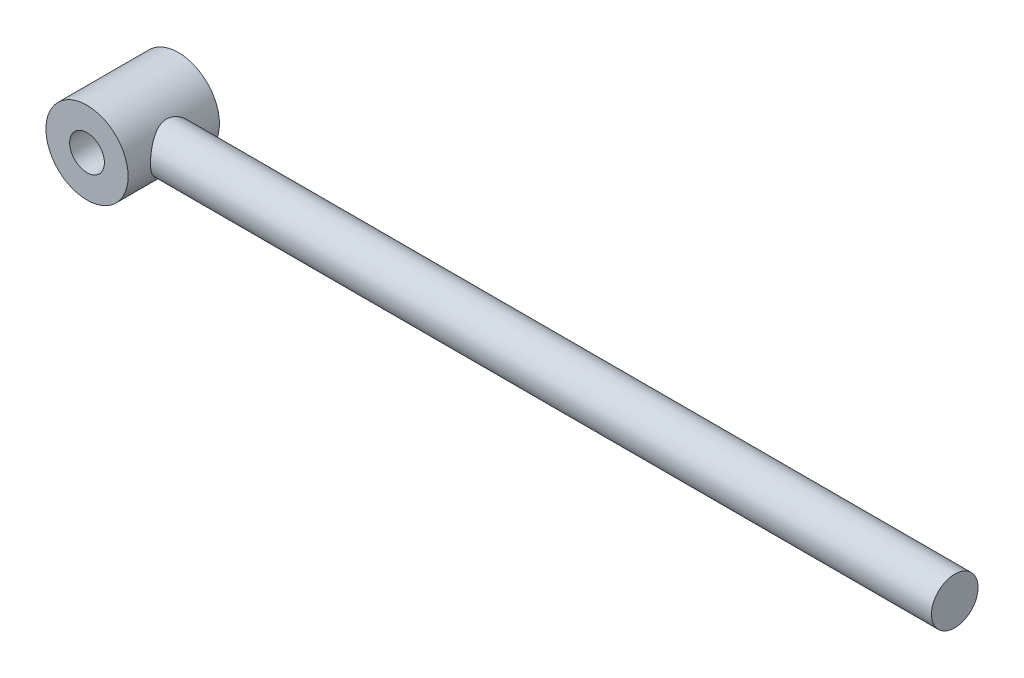
ISO-10303-21;
HEADER;
FILE_DESCRIPTION(('STEP AP214'),'2;1');
FILE_NAME('part.step','',(''),(''),'','','');
FILE_SCHEMA(('AUTOMOTIVE_DESIGN { 1 0 10303 214 1 1 1 1 }'));
ENDSEC;
DATA;
#1=APPLICATION_CONTEXT('core data for automotive mechanical design processes');
#2=APPLICATION_PROTOCOL_DEFINITION('international standard','automotive_design',2000,#1);
#3=PRODUCT_CONTEXT('',#1,'mechanical');
#4=PRODUCT('Part','Part','',(#3));
#5=PRODUCT_RELATED_PRODUCT_CATEGORY('part','',(#4));
#6=PRODUCT_DEFINITION_FORMATION('','',#4);
#7=PRODUCT_DEFINITION_CONTEXT('part definition',#1,'design');
#8=PRODUCT_DEFINITION('design','',#6,#7);
#9=PRODUCT_DEFINITION_SHAPE('','',#8);
#10=(LENGTH_UNIT() NAMED_UNIT(*) SI_UNIT(.MILLI.,.METRE.));
#11=(NAMED_UNIT(*) PLANE_ANGLE_UNIT() SI_UNIT($,.RADIAN.));
#12=(NAMED_UNIT(*) SI_UNIT($,.STERADIAN.) SOLID_ANGLE_UNIT());
#13=UNCERTAINTY_MEASURE_WITH_UNIT(LENGTH_MEASURE(1.E-05),#10,'distance_accuracy_value','');
#14=(GEOMETRIC_REPRESENTATION_CONTEXT(3) GLOBAL_UNCERTAINTY_ASSIGNED_CONTEXT((#13)) GLOBAL_UNIT_ASSIGNED_CONTEXT((#10,
#11,#12)) REPRESENTATION_CONTEXT('',''));
#15=CARTESIAN_POINT('',(0.,0.,0.));
#16=DIRECTION('',(0.,0.,1.));
#17=DIRECTION('',(1.,0.,0.));
#18=AXIS2_PLACEMENT_3D('',#15,#16,#17);
#19=CARTESIAN_POINT('',(0.,0.,0.));
#20=DIRECTION('',(-1.,0.,0.));
#21=DIRECTION('',(0.,0.,1.));
#22=AXIS2_PLACEMENT_3D('',#19,#20,#21);
#23=CYLINDRICAL_SURFACE('',#22,51.);
#24=CARTESIAN_POINT('',(1800.,0.,0.));
#25=DIRECTION('',(-1.,0.,0.));
#26=DIRECTION('',(0.,0.,1.));
#27=AXIS2_PLACEMENT_3D('',#24,#25,#26);
#28=CIRCLE('',#27,51.);
#29=CARTESIAN_POINT('',(1800.,0.,51.));
#30=VERTEX_POINT('',#29);
#31=EDGE_CURVE('E41',#30,#30,#28,.T.);
#32=ORIENTED_EDGE('',*,*,#31,.T.);
#33=EDGE_LOOP('',(#32));
#34=FACE_BOUND('',#33,.T.);
#35=CARTESIAN_POINT('',(90.,0.,51.));
#36=CARTESIAN_POINT('',(89.9999999080098,0.658621829089506,50.9999999638465));
#37=CARTESIAN_POINT('',(89.9927659409652,1.31726335082432,50.9872373579732));
#38=CARTESIAN_POINT('',(89.963875940105,2.6333116588061,50.9362288169427));
#39=CARTESIAN_POINT('',(89.9422180661184,3.29071827677375,50.8979796302622));
#40=CARTESIAN_POINT('',(89.8845999398963,4.60330008210929,50.796093324817));
#41=CARTESIAN_POINT('',(89.8486320450583,5.25847388810619,50.7324426397303));
#42=CARTESIAN_POINT('',(89.7626314540965,6.5649784126537,50.5799750381786));
#43=CARTESIAN_POINT('',(89.7125972735262,7.21630871818016,50.4911554655768));
#44=CARTESIAN_POINT('',(89.541576177841,9.16560794786795,50.1868782531181));
#45=CARTESIAN_POINT('',(89.3997926424242,10.4561460536715,49.9338157269512));
#46=CARTESIAN_POINT('',(89.0644314781864,13.0070316657186,49.3308773469284));
#47=CARTESIAN_POINT('',(88.8708619029722,14.2673838332092,48.9810165465557));
#48=CARTESIAN_POINT('',(88.4375659404354,16.7442503215382,48.1903711505728));
#49=CARTESIAN_POINT('',(88.198063716426,17.9609448011078,47.7500274187819));
#50=CARTESIAN_POINT('',(87.6777020699198,20.3498240387217,46.781898357253));
#51=CARTESIAN_POINT('',(87.3968411907211,21.5220072271947,46.2541099475257));
#52=CARTESIAN_POINT('',(86.799909037017,23.8155292153693,45.1160590879025));
#53=CARTESIAN_POINT('',(86.4838533404445,24.9368902031949,44.5058331012392));
#54=CARTESIAN_POINT('',(85.8228734757845,27.124534036798,43.2073820155322));
#55=CARTESIAN_POINT('',(85.4779482752954,28.1908149106503,42.5191541267528));
#56=CARTESIAN_POINT('',(84.7405311277791,30.3384546740823,41.017261800924));
#57=CARTESIAN_POINT('',(84.3464015054075,31.4154402991066,40.1981469948753));
#58=CARTESIAN_POINT('',(83.5414364416782,33.4973771522562,38.4804786321007));
#59=CARTESIAN_POINT('',(83.1306003033369,34.5023253701914,37.5819217592699));
#60=CARTESIAN_POINT('',(82.3007860533188,36.4374829845075,35.708893441112));
#61=CARTESIAN_POINT('',(81.881799517757,37.3676093260092,34.7343399362332));
#62=CARTESIAN_POINT('',(81.0455462987467,39.1482712819762,32.7143073059673));
#63=CARTESIAN_POINT('',(80.6282797011267,39.9988029693862,31.6688246854519));
#64=CARTESIAN_POINT('',(79.7614626999218,41.7027261083245,29.3957377024492));
#65=CARTESIAN_POINT('',(79.3132112113563,42.5467613273708,28.1605986568506));
#66=CARTESIAN_POINT('',(78.4449790216047,44.1270721785443,25.6134339740721));
#67=CARTESIAN_POINT('',(78.0250022389618,44.8633328909218,24.3013977267786));
#68=CARTESIAN_POINT('',(77.2286824809824,46.2206579184427,21.6083683591209));
#69=CARTESIAN_POINT('',(76.8522868032307,46.8418619282162,20.2274614786219));
#70=CARTESIAN_POINT('',(76.157742904245,47.9628363133805,17.403233338064));
#71=CARTESIAN_POINT('',(75.8395760059921,48.4626456432887,15.9599322753577));
#72=CARTESIAN_POINT('',(75.3374309399517,49.2385595362806,13.3417012963912));
#73=CARTESIAN_POINT('',(75.1393199933618,49.5396785437326,12.176841997503));
#74=CARTESIAN_POINT('',(74.793766117107,50.059868088418,9.82157410141827));
#75=CARTESIAN_POINT('',(74.6463158356272,50.2789505311145,8.63116923802484));
#76=CARTESIAN_POINT('',(74.4072083723645,50.6321337009234,6.23332134679893));
#77=CARTESIAN_POINT('',(74.3155015017695,50.7663101163451,5.0258944775222));
#78=CARTESIAN_POINT('',(74.1909845181348,50.9481117249097,2.60145037472673));
#79=CARTESIAN_POINT('',(74.1581755996714,50.9957351625736,1.38443294719382));
#80=CARTESIAN_POINT('',(74.1526830467022,51.0037217359899,-1.05157440926389));
#81=CARTESIAN_POINT('',(74.180075946213,50.963973797304,-2.27056487806642));
#82=CARTESIAN_POINT('',(74.2941158407597,50.7975826648369,-4.69977416705972));
#83=CARTESIAN_POINT('',(74.3807630594106,50.6709391431277,-5.90999295413037));
#84=CARTESIAN_POINT('',(74.6102216217104,50.3324592330041,-8.31370266771475));
#85=CARTESIAN_POINT('',(74.7530651363031,50.1205740443403,-9.50718360620883));
#86=CARTESIAN_POINT('',(75.0900028869837,49.6143494553413,-11.8690890933385));
#87=CARTESIAN_POINT('',(75.2840983583419,49.3200080676435,-13.0375130373185));
#88=CARTESIAN_POINT('',(75.7167889255936,48.6531109085487,-15.3397307961167));
#89=CARTESIAN_POINT('',(75.9552620751651,48.2807691316978,-16.4736098321381));
#90=CARTESIAN_POINT('',(76.4702108944933,47.460941684386,-18.7048609988401));
#91=CARTESIAN_POINT('',(76.746686136222,47.0134568602692,-19.8022335405304));
#92=CARTESIAN_POINT('',(77.3305788801429,46.046719396909,-21.9566409068548));
#93=CARTESIAN_POINT('',(77.6380040475136,45.5274489670226,-23.0136656489587));
#94=CARTESIAN_POINT('',(78.2766077355745,44.4205017185265,-25.083799642933));
#95=CARTESIAN_POINT('',(78.6077880568575,43.8328197123498,-26.0969055564873));
#96=CARTESIAN_POINT('',(79.3405457668675,42.4940951863819,-28.232623593674));
#97=CARTESIAN_POINT('',(79.7449843122264,41.731908692777,-29.3472834811856));
#98=CARTESIAN_POINT('',(80.565974156775,40.1240415781845,-31.5099544226446));
#99=CARTESIAN_POINT('',(80.982526444613,39.2783541288005,-32.5579600143118));
#100=CARTESIAN_POINT('',(81.8181702318612,37.5066259263467,-34.5841790552293));
#101=CARTESIAN_POINT('',(82.2372634312384,36.5805241460756,-35.5623384533548));
#102=CARTESIAN_POINT('',(83.0682309729032,34.6521475700522,-37.4438700510101));
#103=CARTESIAN_POINT('',(83.4801049955662,33.6498694120686,-38.3472389457965));
#104=CARTESIAN_POINT('',(84.3320834946109,31.4583823518264,-40.1698785072367));
#105=CARTESIAN_POINT('',(84.7702959424847,30.2607460450239,-41.079927457434));
#106=CARTESIAN_POINT('',(85.6148039395976,27.7816327654551,-42.7954697806354));
#107=CARTESIAN_POINT('',(86.0210966706306,26.5001484079733,-43.6009539256527));
#108=CARTESIAN_POINT('',(86.5978279403758,24.5211952877012,-44.7245649455254));
#109=CARTESIAN_POINT('',(86.7846082079466,23.8521396765897,-45.0849766762772));
#110=CARTESIAN_POINT('',(87.1459840483812,22.4959894921595,-45.7767365070799));
#111=CARTESIAN_POINT('',(87.3205811146447,21.8088971440185,-46.1080881705564));
#112=CARTESIAN_POINT('',(87.6562968019721,20.4177791942096,-46.7407556856728));
#113=CARTESIAN_POINT('',(87.8174150206289,19.7137530877965,-47.0420706406266));
#114=CARTESIAN_POINT('',(88.1249153991751,18.2901462710512,-47.6136404049767));
#115=CARTESIAN_POINT('',(88.2712996382287,17.5705677728297,-47.8838995975264));
#116=CARTESIAN_POINT('',(88.5385608794815,16.1677764093895,-48.3747467603549));
#117=CARTESIAN_POINT('',(88.6605040170533,15.4855175082336,-48.5974825288622));
#118=CARTESIAN_POINT('',(88.8897798728475,14.1100343641761,-49.0145213916747));
#119=CARTESIAN_POINT('',(88.9971145585372,13.4168116119517,-49.2088283150436));
#120=CARTESIAN_POINT('',(89.1964259760255,12.0206039754423,-49.5683850908902));
#121=CARTESIAN_POINT('',(89.2884010823263,11.317618066443,-49.7336318680429));
#122=CARTESIAN_POINT('',(89.4562882588614,9.90350424911977,-50.0344189682704));
#123=CARTESIAN_POINT('',(89.5322022707981,9.19237733597049,-50.169962882337));
#124=CARTESIAN_POINT('',(89.6673617485588,7.76392696430004,-50.41076959027));
#125=CARTESIAN_POINT('',(89.7266182413271,7.04660793058549,-50.5160524174128));
#126=CARTESIAN_POINT('',(89.8280680770903,5.60703269557511,-50.6960287730588));
#127=CARTESIAN_POINT('',(89.8702635183636,4.88477711252544,-50.7707260631834));
#128=CARTESIAN_POINT('',(89.9372699532949,3.43693586309107,-50.8892419338477));
#129=CARTESIAN_POINT('',(89.9620813904866,2.71135028214307,-50.9330613022037));
#130=CARTESIAN_POINT('',(89.9941329310163,1.25865312507203,-50.9896499692921));
#131=CARTESIAN_POINT('',(90.001373553904,0.531541594705959,-51.0024201861136));
#132=CARTESIAN_POINT('',(89.9969936872876,-1.47638389890575,-50.9947013143533));
#133=CARTESIAN_POINT('',(89.9668133843013,-2.75723343120374,-50.9414829211875));
#134=CARTESIAN_POINT('',(89.8523806343057,-5.30858719254371,-50.7391078399841));
#135=CARTESIAN_POINT('',(89.7681333730172,-6.57909240190649,-50.5899603527848));
#136=CARTESIAN_POINT('',(89.5476147239068,-9.1009103041784,-50.1976257642642));
#137=CARTESIAN_POINT('',(89.4113434734704,-10.3522230477621,-49.9544389112832));
#138=CARTESIAN_POINT('',(89.0899579958287,-12.8271939809243,-49.3768986727185));
#139=CARTESIAN_POINT('',(88.9048422579934,-14.0508513139236,-49.0425424674987));
#140=CARTESIAN_POINT('',(88.4916576790017,-16.4529502503529,-48.2894573980557));
#141=CARTESIAN_POINT('',(88.2639579382878,-17.6316827584081,-47.8714515423615));
#142=CARTESIAN_POINT('',(87.7694320181899,-19.9481738196302,-46.9534100687694));
#143=CARTESIAN_POINT('',(87.5026065498138,-21.0859331169102,-46.4533759415012));
#144=CARTESIAN_POINT('',(86.9351461710868,-23.3153104056928,-45.3754298540803));
#145=CARTESIAN_POINT('',(86.6345065737994,-24.4069219717902,-44.7975070956698));
#146=CARTESIAN_POINT('',(86.005207606609,-26.5394133992691,-43.5680456513692));
#147=CARTESIAN_POINT('',(85.6765465439721,-27.5802901898624,-42.9165025174103));
#148=CARTESIAN_POINT('',(84.9619697203931,-29.7128949367533,-41.4725198822472));
#149=CARTESIAN_POINT('',(84.5736529261476,-30.7986733738008,-40.672474911166));
#150=CARTESIAN_POINT('',(83.7787599039084,-32.8995612511497,-38.9926674392049));
#151=CARTESIAN_POINT('',(83.3721825877715,-33.9146664708234,-38.1129001844929));
#152=CARTESIAN_POINT('',(82.5491771761691,-35.8714523155851,-36.2772713886441));
#153=CARTESIAN_POINT('',(82.1327391410625,-36.8130543512525,-35.3213305505431));
#154=CARTESIAN_POINT('',(81.2996554355955,-38.6180559611656,-33.338319878606));
#155=CARTESIAN_POINT('',(80.8830097568634,-39.4814520734855,-32.3112468995257));
#156=CARTESIAN_POINT('',(80.0144704178768,-41.2155787546037,-30.0747321295558));
#157=CARTESIAN_POINT('',(79.5636537408907,-42.076952315911,-28.8575917389523));
#158=CARTESIAN_POINT('',(78.6874493391874,-43.6936042528538,-26.345774335025));
#159=CARTESIAN_POINT('',(78.2620651732776,-44.4488678002318,-25.0510865208853));
#160=CARTESIAN_POINT('',(77.4518243815826,-45.8461187715082,-22.3916727050435));
#161=CARTESIAN_POINT('',(77.0669234400933,-46.4882305904279,-21.0270257724713));
#162=CARTESIAN_POINT('',(76.352186989999,-47.6530279235343,-18.2339401650692));
#163=CARTESIAN_POINT('',(76.0223346573275,-48.1757499439386,-16.805521150179));
#164=CARTESIAN_POINT('',(75.494881569909,-48.9970172604456,-14.2034744784127));
#165=CARTESIAN_POINT('',(75.2840690808904,-49.319595037728,-13.0400628721239));
#166=CARTESIAN_POINT('',(74.9121826729371,-49.8826527142441,-10.6857467270169));
#167=CARTESIAN_POINT('',(74.7511017863522,-50.1231441146953,-9.49484606470611));
#168=CARTESIAN_POINT('',(74.4842419549075,-50.5188559552848,-7.09394000656582));
#169=CARTESIAN_POINT('',(74.3784114318117,-50.6741559316347,-5.88395351933119));
#170=CARTESIAN_POINT('',(74.2256385593451,-50.8976724790169,-3.45219522164396));
#171=CARTESIAN_POINT('',(74.1786972028402,-50.9658875818067,-2.23042321283849));
#172=CARTESIAN_POINT('',(74.1454423292355,-51.0142557414332,0.217869510479798));
#173=CARTESIAN_POINT('',(74.1592365462583,-50.9942523141599,1.44439480440881));
#174=CARTESIAN_POINT('',(74.2471733831332,-50.8661300349446,3.89063168992981));
#175=CARTESIAN_POINT('',(74.3213162247863,-50.7580108591482,5.11034325646252));
#176=CARTESIAN_POINT('',(74.5272502695304,-50.4551515871639,7.53464579954017));
#177=CARTESIAN_POINT('',(74.6590726861857,-50.2603645893257,8.73922822529333));
#178=CARTESIAN_POINT('',(74.975721639457,-49.7867659406473,11.1246000242888));
#179=CARTESIAN_POINT('',(75.1605491938781,-49.5079526763287,12.3053889401819));
#180=CARTESIAN_POINT('',(75.5744624632198,-48.873734095437,14.6212511530489));
#181=CARTESIAN_POINT('',(75.8029442451188,-48.5193670512466,15.7567183823887));
#182=CARTESIAN_POINT('',(76.2990239978591,-47.7354575376076,17.9924852136079));
#183=CARTESIAN_POINT('',(76.5666212744269,-47.3059164024215,19.0927854392555));
#184=CARTESIAN_POINT('',(77.1340047879293,-46.3750184134558,21.2542398804707));
#185=CARTESIAN_POINT('',(77.433798713522,-45.8736443961734,22.3153846639501));
#186=CARTESIAN_POINT('',(78.0584751360182,-44.8024427111638,24.3948628941343));
#187=CARTESIAN_POINT('',(78.3833595278239,-44.2326098714258,25.4131930983752));
#188=CARTESIAN_POINT('',(79.1025080007826,-42.9351170617432,27.5567906797734));
#189=CARTESIAN_POINT('',(79.4997735792166,-42.196653401375,28.6745243640083));
#190=CARTESIAN_POINT('',(80.3082569704127,-40.6368746646193,30.8452759396548));
#191=CARTESIAN_POINT('',(80.7194759048475,-39.8155529169711,31.8982886090977));
#192=CARTESIAN_POINT('',(81.5464468985148,-38.093177640721,33.9365783211935));
#193=CARTESIAN_POINT('',(81.962202190492,-37.1920634861879,34.9218028310643));
#194=CARTESIAN_POINT('',(82.7886409375823,-35.3142099569444,36.8196796696559));
#195=CARTESIAN_POINT('',(83.199324191675,-34.3374675959372,37.7323291297513));
#196=CARTESIAN_POINT('',(84.0545363166318,-32.1919446719896,39.5843076939503));
#197=CARTESIAN_POINT('',(84.4973161979926,-31.0141187643169,40.5140042579292));
#198=CARTESIAN_POINT('',(85.3534565316603,-28.5737575457024,42.2705655413673));
#199=CARTESIAN_POINT('',(85.7668131210497,-27.3112111541161,43.0974167691062));
#200=CARTESIAN_POINT('',(86.5524819206644,-24.7085981173113,44.6404852101773));
#201=CARTESIAN_POINT('',(86.9248078896111,-23.3685576892637,45.3567395422792));
#202=CARTESIAN_POINT('',(87.6177098919915,-20.619048375455,46.6709221329511));
#203=CARTESIAN_POINT('',(87.9383002122615,-19.2095987978845,47.2688830686653));
#204=CARTESIAN_POINT('',(88.4666204644227,-16.5866461534593,48.2439567469611));
#205=CARTESIAN_POINT('',(88.6842827873246,-15.3826718083376,48.6414277334775));
#206=CARTESIAN_POINT('',(89.0732813861891,-12.9413176535385,49.3471002732022));
#207=CARTESIAN_POINT('',(89.2446157274773,-11.7039364511504,49.6552980983671));
#208=CARTESIAN_POINT('',(89.5366089910759,-9.20715383655438,50.1781948403393));
#209=CARTESIAN_POINT('',(89.6573997818891,-7.94781876869649,50.3931371163359));
#210=CARTESIAN_POINT('',(89.8460390921215,-5.41314805150744,50.7280009673489));
#211=CARTESIAN_POINT('',(89.9139191647683,-4.13782239996108,50.8479791747056));
#212=CARTESIAN_POINT('',(89.9696982299905,-2.38343476336418,50.9465097237543));
#213=CARTESIAN_POINT('',(89.9810558407358,-1.90708597838184,50.9665623322879));
#214=CARTESIAN_POINT('',(89.9962070833674,-0.953828267200443,50.993308056316));
#215=CARTESIAN_POINT('',(90.0000000666117,-0.47691929647523,51.0000000261793));
#216=CARTESIAN_POINT('',(90.,0.,51.));
#217=B_SPLINE_CURVE_WITH_KNOTS('',3,(#35,#36,#37,#38,#39,#40,#41,#42,#43,#44,#45,#46,#47,#48,
#49,#50,#51,#52,#53,#54,#55,#56,#57,#58,#59,#60,#61,#62,#63,#64,#65,#66,#67,#68,#69,#70,#71,#72,
#73,#74,#75,#76,#77,#78,#79,#80,#81,#82,#83,#84,#85,#86,#87,#88,#89,#90,#91,#92,#93,#94,#95,#96,
#97,#98,#99,#100,#101,#102,#103,#104,#105,#106,#107,#108,#109,#110,#111,#112,#113,#114,#115,
#116,#117,#118,#119,#120,#121,#122,#123,#124,#125,#126,#127,#128,#129,#130,#131,#132,#133,#134,
#135,#136,#137,#138,#139,#140,#141,#142,#143,#144,#145,#146,#147,#148,#149,#150,#151,#152,#153,
#154,#155,#156,#157,#158,#159,#160,#161,#162,#163,#164,#165,#166,#167,#168,#169,#170,#171,#172,
#173,#174,#175,#176,#177,#178,#179,#180,#181,#182,#183,#184,#185,#186,#187,#188,#189,#190,#191,
#192,#193,#194,#195,#196,#197,#198,#199,#200,#201,#202,#203,#204,#205,#206,#207,#208,#209,#210,
#211,#212,#213,#214,#215,#216),.UNSPECIFIED.,.T.,.F.,(4,2,2,2,2,2,2,2,2,2,2,2,2,2,2,2,2,2,2,2,2,
2,2,2,2,2,2,2,2,2,2,2,2,2,2,2,2,2,2,2,2,2,2,2,2,2,2,2,2,2,2,2,2,2,2,2,2,2,2,2,2,2,2,2,2,2,2,2,2,
2,2,2,2,2,2,2,2,2,2,2,2,2,2,2,2,2,2,2,2,2,4),(0.,1.97573506750727,3.95172224332546,
5.92876616115687,7.90601879923131,11.8687458840348,15.8308570554968,19.774102711734,
23.7174872870797,27.659133327337,31.6009203849575,35.8245523399237,40.0483606828702,
44.2767946949686,48.5054372204362,53.1847586222127,57.8647271938523,62.5389758501369,
67.2117225923282,70.8660166020477,74.5197800807845,78.1702818568947,81.8208576721372,
85.4760771150775,89.1313103522208,92.7886391690982,96.4460561426478,100.093567386924,
103.741037551654,107.389413295701,111.038065872099,115.262564810515,119.487409499245,
123.71548896453,127.943755154965,132.638058060786,137.332774964021,139.679797850467,
142.026532534909,144.373337255469,146.719810344422,148.902996172504,151.085887677389,
153.26901005056,155.451868344647,157.633278208993,159.81441970778,161.995505555116,
164.176526909358,168.018276911844,171.85965849585,175.701029935564,179.542520192601,
183.352139680087,187.161689946274,190.97176890198,194.782078182024,198.98819732823,
203.194567450167,207.405375105319,211.616369068438,216.283991031597,220.952264620369,
225.615373613875,230.277054838366,233.950021963286,237.622474253071,241.291492015986,
244.96057163737,248.63616217394,252.31176621958,255.989361799851,259.667028002072,
263.29708388916,266.927075353036,270.557935605603,274.189070339541,278.376778340447,
282.56482378122,286.756079042128,290.947499885723,295.635126956253,300.323368323951,
305.010032777742,309.695400782862,313.550614931429,317.405990050363,321.251242785821,
325.094200652454,326.524741443788,327.955404894041),.UNSPECIFIED.);
#218=CARTESIAN_POINT('',(90.,0.,51.));
#219=VERTEX_POINT('',#218);
#220=EDGE_CURVE('E10',#219,#219,#217,.T.);
#221=ORIENTED_EDGE('',*,*,#220,.F.);
#222=EDGE_LOOP('',(#221));
#223=FACE_BOUND('',#222,.T.);
#224=ADVANCED_FACE('F31',(#34,#223),#23,.T.);
#225=CARTESIAN_POINT('',(1800.,0.,0.));
#226=DIRECTION('',(-1.,0.,0.));
#227=DIRECTION('',(0.,0.,1.));
#228=AXIS2_PLACEMENT_3D('',#225,#226,#227);
#229=PLANE('',#228);
#230=ORIENTED_EDGE('',*,*,#31,.F.);
#231=EDGE_LOOP('',(#230));
#232=FACE_BOUND('',#231,.T.);
#233=ADVANCED_FACE('F78',(#232),#229,.F.);
#234=CARTESIAN_POINT('',(0.,0.,100.));
#235=DIRECTION('',(0.,0.,-1.));
#236=DIRECTION('',(-1.,0.,0.));
#237=AXIS2_PLACEMENT_3D('',#234,#235,#236);
#238=CYLINDRICAL_SURFACE('',#237,90.);
#239=CARTESIAN_POINT('',(0.,0.,-100.));
#240=DIRECTION('',(0.,0.,1.));
#241=DIRECTION('',(1.,0.,0.));
#242=AXIS2_PLACEMENT_3D('',#239,#240,#241);
#243=CIRCLE('',#242,90.);
#244=CARTESIAN_POINT('',(90.,0.,-100.));
#245=VERTEX_POINT('',#244);
#246=EDGE_CURVE('E49',#245,#245,#243,.T.);
#247=ORIENTED_EDGE('',*,*,#246,.T.);
#248=EDGE_LOOP('',(#247));
#249=FACE_BOUND('',#248,.T.);
#250=CARTESIAN_POINT('',(0.,0.,100.));
#251=DIRECTION('',(0.,0.,1.));
#252=DIRECTION('',(1.,0.,0.));
#253=AXIS2_PLACEMENT_3D('',#250,#251,#252);
#254=CIRCLE('',#253,90.);
#255=CARTESIAN_POINT('',(90.,0.,100.));
#256=VERTEX_POINT('',#255);
#257=EDGE_CURVE('E45',#256,#256,#254,.T.);
#258=ORIENTED_EDGE('',*,*,#257,.F.);
#259=EDGE_LOOP('',(#258));
#260=FACE_BOUND('',#259,.T.);
#261=ORIENTED_EDGE('',*,*,#220,.T.);
#262=EDGE_LOOP('',(#261));
#263=FACE_BOUND('',#262,.T.);
#264=ADVANCED_FACE('F74',(#249,#260,#263),#238,.T.);
#265=CARTESIAN_POINT('',(0.,0.,100.));
#266=DIRECTION('',(0.,0.,-1.));
#267=DIRECTION('',(-1.,0.,0.));
#268=AXIS2_PLACEMENT_3D('',#265,#266,#267);
#269=CYLINDRICAL_SURFACE('',#268,38.);
#270=CARTESIAN_POINT('',(0.,0.,-100.));
#271=DIRECTION('',(0.,0.,1.));
#272=DIRECTION('',(1.,0.,0.));
#273=AXIS2_PLACEMENT_3D('',#270,#271,#272);
#274=CIRCLE('',#273,38.);
#275=CARTESIAN_POINT('',(38.,0.,-100.));
#276=VERTEX_POINT('',#275);
#277=EDGE_CURVE('E55',#276,#276,#274,.T.);
#278=ORIENTED_EDGE('',*,*,#277,.F.);
#279=EDGE_LOOP('',(#278));
#280=FACE_BOUND('',#279,.T.);
#281=CARTESIAN_POINT('',(0.,0.,100.));
#282=DIRECTION('',(0.,0.,1.));
#283=DIRECTION('',(1.,0.,0.));
#284=AXIS2_PLACEMENT_3D('',#281,#282,#283);
#285=CIRCLE('',#284,38.);
#286=CARTESIAN_POINT('',(38.,0.,100.));
#287=VERTEX_POINT('',#286);
#288=EDGE_CURVE('E53',#287,#287,#285,.T.);
#289=ORIENTED_EDGE('',*,*,#288,.T.);
#290=EDGE_LOOP('',(#289));
#291=FACE_BOUND('',#290,.T.);
#292=ADVANCED_FACE('F61',(#280,#291),#269,.F.);
#293=CARTESIAN_POINT('',(0.,0.,100.));
#294=DIRECTION('',(0.,0.,1.));
#295=DIRECTION('',(1.,0.,0.));
#296=AXIS2_PLACEMENT_3D('',#293,#294,#295);
#297=PLANE('',#296);
#298=ORIENTED_EDGE('',*,*,#257,.T.);
#299=EDGE_LOOP('',(#298));
#300=FACE_BOUND('',#299,.T.);
#301=ORIENTED_EDGE('',*,*,#288,.F.);
#302=EDGE_LOOP('',(#301));
#303=FACE_BOUND('',#302,.T.);
#304=ADVANCED_FACE('F63',(#300,#303),#297,.T.);
#305=CARTESIAN_POINT('',(0.,0.,-100.));
#306=DIRECTION('',(0.,0.,1.));
#307=DIRECTION('',(1.,0.,0.));
#308=AXIS2_PLACEMENT_3D('',#305,#306,#307);
#309=PLANE('',#308);
#310=ORIENTED_EDGE('',*,*,#246,.F.);
#311=EDGE_LOOP('',(#310));
#312=FACE_BOUND('',#311,.T.);
#313=ORIENTED_EDGE('',*,*,#277,.T.);
#314=EDGE_LOOP('',(#313));
#315=FACE_BOUND('',#314,.T.);
#316=ADVANCED_FACE('F65',(#312,#315),#309,.F.);
#317=CLOSED_SHELL('',(#224,#233,#264,#292,#304,#316));
#318=MANIFOLD_SOLID_BREP('B2',#317);
#319=ADVANCED_BREP_SHAPE_REPRESENTATION('',(#18,#318),#14);
#320=SHAPE_DEFINITION_REPRESENTATION(#9,#319);
ENDSEC;
END-ISO-10303-21;
